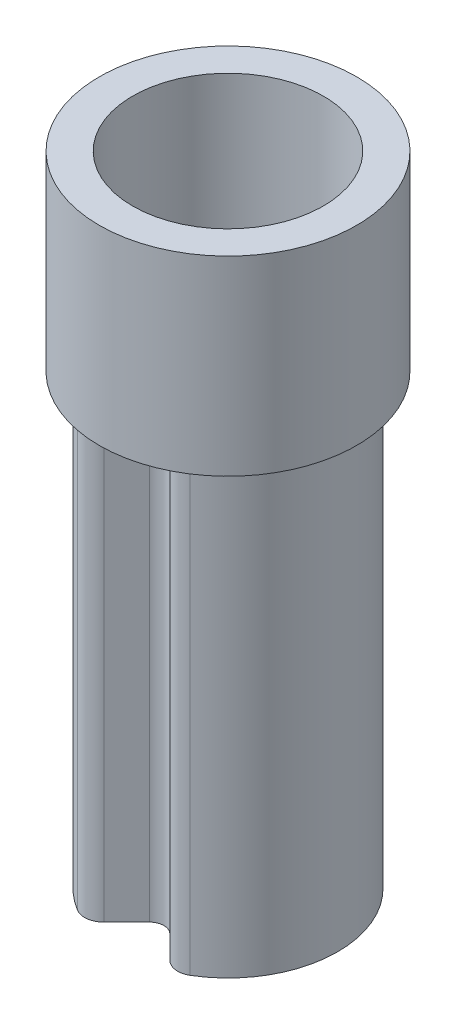
ISO-10303-21;
HEADER;
FILE_DESCRIPTION(('STEP AP214'),'2;1');
FILE_NAME('part.step','',(''),(''),'','','');
FILE_SCHEMA(('AUTOMOTIVE_DESIGN { 1 0 10303 214 1 1 1 1 }'));
ENDSEC;
DATA;
#1=APPLICATION_CONTEXT('core data for automotive mechanical design processes');
#2=APPLICATION_PROTOCOL_DEFINITION('international standard','automotive_design',2000,#1);
#3=PRODUCT_CONTEXT('',#1,'mechanical');
#4=PRODUCT('Part','Part','',(#3));
#5=PRODUCT_RELATED_PRODUCT_CATEGORY('part','',(#4));
#6=PRODUCT_DEFINITION_FORMATION('','',#4);
#7=PRODUCT_DEFINITION_CONTEXT('part definition',#1,'design');
#8=PRODUCT_DEFINITION('design','',#6,#7);
#9=PRODUCT_DEFINITION_SHAPE('','',#8);
#10=(LENGTH_UNIT() NAMED_UNIT(*) SI_UNIT(.MILLI.,.METRE.));
#11=(NAMED_UNIT(*) PLANE_ANGLE_UNIT() SI_UNIT($,.RADIAN.));
#12=(NAMED_UNIT(*) SI_UNIT($,.STERADIAN.) SOLID_ANGLE_UNIT());
#13=UNCERTAINTY_MEASURE_WITH_UNIT(LENGTH_MEASURE(1.E-05),#10,'distance_accuracy_value','');
#14=(GEOMETRIC_REPRESENTATION_CONTEXT(3) GLOBAL_UNCERTAINTY_ASSIGNED_CONTEXT((#13)) GLOBAL_UNIT_ASSIGNED_CONTEXT((#10,
#11,#12)) REPRESENTATION_CONTEXT('',''));
#15=CARTESIAN_POINT('',(0.,0.,0.));
#16=DIRECTION('',(0.,0.,1.));
#17=DIRECTION('',(1.,0.,0.));
#18=AXIS2_PLACEMENT_3D('',#15,#16,#17);
#19=CARTESIAN_POINT('',(0.,4.7,0.822132034355964));
#20=DIRECTION('',(0.,1.,0.));
#21=DIRECTION('',(0.,0.,1.));
#22=AXIS2_PLACEMENT_3D('',#19,#20,#21);
#23=PLANE('',#22);
#24=DIRECTION('',(0.707106781186548,0.,0.707106781186548));
#25=VECTOR('',#24,1.);
#26=CARTESIAN_POINT('',(0.106066017177983,4.7,0.716066017177983));
#27=LINE('',#26,#25);
#28=CARTESIAN_POINT('',(0.106066017177983,4.7,0.716066017177983));
#29=VERTEX_POINT('',#28);
#30=CARTESIAN_POINT('',(0.332945922473057,4.7,0.942945922473057));
#31=VERTEX_POINT('',#30);
#32=EDGE_CURVE('E154',#29,#31,#27,.T.);
#33=ORIENTED_EDGE('',*,*,#32,.T.);
#34=CARTESIAN_POINT('',(0.,4.7,0.));
#35=DIRECTION('',(0.,1.,0.));
#36=DIRECTION('',(0.,0.,1.));
#37=AXIS2_PLACEMENT_3D('',#34,#35,#36);
#38=CIRCLE('',#37,1.);
#39=CARTESIAN_POINT('',(0.513633561053512,4.7,0.858009653185492));
#40=VERTEX_POINT('',#39);
#41=EDGE_CURVE('E137',#31,#40,#38,.T.);
#42=ORIENTED_EDGE('',*,*,#41,.T.);
#43=CARTESIAN_POINT('',(0.487951883000836,4.7,0.815109170526217));
#44=DIRECTION('',(0.,1.,0.));
#45=DIRECTION('',(0.,0.,1.));
#46=AXIS2_PLACEMENT_3D('',#43,#44,#45);
#47=CIRCLE('',#46,0.05);
#48=CARTESIAN_POINT('',(0.452596543941509,4.7,0.850464509585545));
#49=VERTEX_POINT('',#48);
#50=EDGE_CURVE('E194',#40,#49,#47,.F.);
#51=ORIENTED_EDGE('',*,*,#50,.T.);
#52=DIRECTION('',(0.707106781186548,0.,0.707106781186547));
#53=VECTOR('',#52,1.);
#54=CARTESIAN_POINT('',(0.212132034355966,4.7,0.610000000000001));
#55=LINE('',#54,#53);
#56=CARTESIAN_POINT('',(0.212132034355966,4.7,0.610000000000002));
#57=VERTEX_POINT('',#56);
#58=EDGE_CURVE('E227',#57,#49,#55,.T.);
#59=ORIENTED_EDGE('',*,*,#58,.F.);
#60=CARTESIAN_POINT('',(0.,4.7,0.822132034355964));
#61=DIRECTION('',(0.,-1.,0.));
#62=DIRECTION('',(0.,0.,1.));
#63=AXIS2_PLACEMENT_3D('',#60,#61,#62);
#64=CIRCLE('',#63,0.3);
#65=CARTESIAN_POINT('',(-0.212132034355965,4.7,0.610000000000001));
#66=VERTEX_POINT('',#65);
#67=EDGE_CURVE('E223',#66,#57,#64,.T.);
#68=ORIENTED_EDGE('',*,*,#67,.F.);
#69=DIRECTION('',(0.707106781186547,0.,-0.707106781186548));
#70=VECTOR('',#69,1.);
#71=CARTESIAN_POINT('',(-0.479612456619358,4.7,0.877480422263394));
#72=LINE('',#71,#70);
#73=CARTESIAN_POINT('',(-0.452596543941509,4.7,0.850464509585545));
#74=VERTEX_POINT('',#73);
#75=EDGE_CURVE('E221',#74,#66,#72,.T.);
#76=ORIENTED_EDGE('',*,*,#75,.F.);
#77=CARTESIAN_POINT('',(-0.487951883000836,4.7,0.815109170526218));
#78=DIRECTION('',(0.,1.,0.));
#79=DIRECTION('',(0.,0.,1.));
#80=AXIS2_PLACEMENT_3D('',#77,#78,#79);
#81=CIRCLE('',#80,0.05);
#82=CARTESIAN_POINT('',(-0.513633561053512,4.7,0.858009653185492));
#83=VERTEX_POINT('',#82);
#84=EDGE_CURVE('E197',#74,#83,#81,.F.);
#85=ORIENTED_EDGE('',*,*,#84,.T.);
#86=CARTESIAN_POINT('',(-0.332945922473057,4.7,0.942945922473057));
#87=VERTEX_POINT('',#86);
#88=EDGE_CURVE('E12',#83,#87,#38,.T.);
#89=ORIENTED_EDGE('',*,*,#88,.T.);
#90=DIRECTION('',(0.707106781186547,0.,-0.707106781186548));
#91=VECTOR('',#90,1.);
#92=CARTESIAN_POINT('',(-0.448807004477936,4.7,1.05880700447794));
#93=LINE('',#92,#91);
#94=CARTESIAN_POINT('',(-0.106066017177983,4.7,0.716066017177983));
#95=VERTEX_POINT('',#94);
#96=EDGE_CURVE('E164',#87,#95,#93,.T.);
#97=ORIENTED_EDGE('',*,*,#96,.T.);
#98=CARTESIAN_POINT('',(0.,4.7,0.822132034355964));
#99=DIRECTION('',(0.,-1.,0.));
#100=DIRECTION('',(0.,0.,1.));
#101=AXIS2_PLACEMENT_3D('',#98,#99,#100);
#102=CIRCLE('',#101,0.15);
#103=EDGE_CURVE('E159',#95,#29,#102,.T.);
#104=ORIENTED_EDGE('',*,*,#103,.T.);
#105=EDGE_LOOP('',(#33,#42,#51,#59,#68,#76,#85,#89,#97,#104));
#106=FACE_BOUND('',#105,.T.);
#107=ADVANCED_FACE('F36',(#106),#23,.T.);
#108=CARTESIAN_POINT('',(0.,0.,0.822132034355964));
#109=DIRECTION('',(0.,1.,0.));
#110=DIRECTION('',(0.,0.,1.));
#111=AXIS2_PLACEMENT_3D('',#108,#109,#110);
#112=PLANE('',#111);
#113=CARTESIAN_POINT('',(0.,0.,0.));
#114=DIRECTION('',(0.,1.,0.));
#115=DIRECTION('',(0.,0.,1.));
#116=AXIS2_PLACEMENT_3D('',#113,#114,#115);
#117=CIRCLE('',#116,1.15);
#118=CARTESIAN_POINT('',(0.590678595211539,0.,0.986711101163316));
#119=VERTEX_POINT('',#118);
#120=CARTESIAN_POINT('',(-0.590678595211538,0.,0.986711101163316));
#121=VERTEX_POINT('',#120);
#122=EDGE_CURVE('E177',#119,#121,#117,.T.);
#123=ORIENTED_EDGE('',*,*,#122,.F.);
#124=CARTESIAN_POINT('',(0.487951883000836,0.,0.815109170526217));
#125=DIRECTION('',(0.,1.,0.));
#126=DIRECTION('',(0.,0.,1.));
#127=AXIS2_PLACEMENT_3D('',#124,#125,#126);
#128=CIRCLE('',#127,0.2);
#129=CARTESIAN_POINT('',(0.346530526763527,0.,0.956530526763527));
#130=VERTEX_POINT('',#129);
#131=EDGE_CURVE('E61',#119,#130,#128,.F.);
#132=ORIENTED_EDGE('',*,*,#131,.T.);
#133=DIRECTION('',(0.707106781186548,0.,0.707106781186548));
#134=VECTOR('',#133,1.);
#135=CARTESIAN_POINT('',(0.106066017177983,0.,0.716066017177983));
#136=LINE('',#135,#134);
#137=CARTESIAN_POINT('',(0.106066017177983,0.,0.716066017177983));
#138=VERTEX_POINT('',#137);
#139=EDGE_CURVE('E174',#138,#130,#136,.T.);
#140=ORIENTED_EDGE('',*,*,#139,.F.);
#141=CARTESIAN_POINT('',(0.,0.,0.822132034355964));
#142=DIRECTION('',(0.,-1.,0.));
#143=DIRECTION('',(0.,0.,1.));
#144=AXIS2_PLACEMENT_3D('',#141,#142,#143);
#145=CIRCLE('',#144,0.15);
#146=CARTESIAN_POINT('',(-0.106066017177983,0.,0.716066017177983));
#147=VERTEX_POINT('',#146);
#148=EDGE_CURVE('E171',#147,#138,#145,.T.);
#149=ORIENTED_EDGE('',*,*,#148,.F.);
#150=DIRECTION('',(0.707106781186547,0.,-0.707106781186548));
#151=VECTOR('',#150,1.);
#152=CARTESIAN_POINT('',(-0.448807004477936,0.,1.05880700447794));
#153=LINE('',#152,#151);
#154=CARTESIAN_POINT('',(-0.346530526763527,0.,0.956530526763527));
#155=VERTEX_POINT('',#154);
#156=EDGE_CURVE('E180',#155,#147,#153,.T.);
#157=ORIENTED_EDGE('',*,*,#156,.F.);
#158=CARTESIAN_POINT('',(-0.487951883000836,0.,0.815109170526217));
#159=DIRECTION('',(0.,1.,0.));
#160=DIRECTION('',(0.,0.,1.));
#161=AXIS2_PLACEMENT_3D('',#158,#159,#160);
#162=CIRCLE('',#161,0.2);
#163=EDGE_CURVE('E204',#155,#121,#162,.F.);
#164=ORIENTED_EDGE('',*,*,#163,.T.);
#165=EDGE_LOOP('',(#123,#132,#140,#149,#157,#164));
#166=FACE_BOUND('',#165,.T.);
#167=DIRECTION('',(0.707106781186548,0.,0.707106781186547));
#168=VECTOR('',#167,1.);
#169=CARTESIAN_POINT('',(0.212132034355966,0.,0.610000000000001));
#170=LINE('',#169,#168);
#171=CARTESIAN_POINT('',(0.212132034355966,0.,0.610000000000002));
#172=VERTEX_POINT('',#171);
#173=CARTESIAN_POINT('',(0.452596543941509,0.,0.850464509585545));
#174=VERTEX_POINT('',#173);
#175=EDGE_CURVE('E224',#172,#174,#170,.T.);
#176=ORIENTED_EDGE('',*,*,#175,.T.);
#177=CARTESIAN_POINT('',(0.487951883000836,0.,0.815109170526217));
#178=DIRECTION('',(0.,1.,0.));
#179=DIRECTION('',(0.,0.,1.));
#180=AXIS2_PLACEMENT_3D('',#177,#178,#179);
#181=CIRCLE('',#180,0.05);
#182=CARTESIAN_POINT('',(0.513633561053512,0.,0.858009653185492));
#183=VERTEX_POINT('',#182);
#184=EDGE_CURVE('E192',#174,#183,#181,.T.);
#185=ORIENTED_EDGE('',*,*,#184,.T.);
#186=CARTESIAN_POINT('',(0.,0.,0.));
#187=DIRECTION('',(0.,1.,0.));
#188=DIRECTION('',(0.,0.,1.));
#189=AXIS2_PLACEMENT_3D('',#186,#187,#188);
#190=CIRCLE('',#189,1.);
#191=CARTESIAN_POINT('',(-0.513633561053512,0.,0.858009653185492));
#192=VERTEX_POINT('',#191);
#193=EDGE_CURVE('E231',#183,#192,#190,.T.);
#194=ORIENTED_EDGE('',*,*,#193,.T.);
#195=CARTESIAN_POINT('',(-0.487951883000836,0.,0.815109170526218));
#196=DIRECTION('',(0.,1.,0.));
#197=DIRECTION('',(0.,0.,1.));
#198=AXIS2_PLACEMENT_3D('',#195,#196,#197);
#199=CIRCLE('',#198,0.05);
#200=CARTESIAN_POINT('',(-0.452596543941509,0.,0.850464509585545));
#201=VERTEX_POINT('',#200);
#202=EDGE_CURVE('E195',#192,#201,#199,.T.);
#203=ORIENTED_EDGE('',*,*,#202,.T.);
#204=DIRECTION('',(0.707106781186547,0.,-0.707106781186548));
#205=VECTOR('',#204,1.);
#206=CARTESIAN_POINT('',(-0.479612456619358,0.,0.877480422263394));
#207=LINE('',#206,#205);
#208=CARTESIAN_POINT('',(-0.212132034355965,0.,0.610000000000001));
#209=VERTEX_POINT('',#208);
#210=EDGE_CURVE('E234',#201,#209,#207,.T.);
#211=ORIENTED_EDGE('',*,*,#210,.T.);
#212=CARTESIAN_POINT('',(0.,0.,0.822132034355964));
#213=DIRECTION('',(0.,-1.,0.));
#214=DIRECTION('',(0.,0.,1.));
#215=AXIS2_PLACEMENT_3D('',#212,#213,#214);
#216=CIRCLE('',#215,0.3);
#217=EDGE_CURVE('E237',#209,#172,#216,.T.);
#218=ORIENTED_EDGE('',*,*,#217,.T.);
#219=EDGE_LOOP('',(#176,#185,#194,#203,#211,#218));
#220=FACE_BOUND('',#219,.T.);
#221=ADVANCED_FACE('F255',(#166,#220),#112,.F.);
#222=CARTESIAN_POINT('',(0.,4.7,0.822132034355964));
#223=DIRECTION('',(0.,-1.,0.));
#224=DIRECTION('',(0.,0.,-1.));
#225=AXIS2_PLACEMENT_3D('',#222,#223,#224);
#226=CYLINDRICAL_SURFACE('',#225,0.15);
#227=ORIENTED_EDGE('',*,*,#148,.T.);
#228=DIRECTION('',(0.,-1.,0.));
#229=VECTOR('',#228,1.);
#230=CARTESIAN_POINT('',(0.106066017177983,4.7,0.716066017177983));
#231=LINE('',#230,#229);
#232=EDGE_CURVE('E184',#29,#138,#231,.T.);
#233=ORIENTED_EDGE('',*,*,#232,.F.);
#234=ORIENTED_EDGE('',*,*,#103,.F.);
#235=DIRECTION('',(0.,-1.,0.));
#236=VECTOR('',#235,1.);
#237=CARTESIAN_POINT('',(-0.106066017177983,4.7,0.716066017177983));
#238=LINE('',#237,#236);
#239=EDGE_CURVE('E170',#95,#147,#238,.T.);
#240=ORIENTED_EDGE('',*,*,#239,.T.);
#241=EDGE_LOOP('',(#227,#233,#234,#240));
#242=FACE_BOUND('',#241,.T.);
#243=ADVANCED_FACE('F291',(#242),#226,.F.);
#244=CARTESIAN_POINT('',(0.106066017177983,4.7,0.716066017177983));
#245=DIRECTION('',(0.707106781186548,0.,-0.707106781186547));
#246=DIRECTION('',(-0.707106781186547,0.,-0.707106781186548));
#247=AXIS2_PLACEMENT_3D('',#244,#245,#246);
#248=PLANE('',#247);
#249=ORIENTED_EDGE('',*,*,#139,.T.);
#250=DIRECTION('',(0.,-1.,0.));
#251=VECTOR('',#250,1.);
#252=CARTESIAN_POINT('',(0.346530526763527,4.7,0.956530526763527));
#253=LINE('',#252,#251);
#254=CARTESIAN_POINT('',(0.346530526763527,4.7,0.956530526763527));
#255=VERTEX_POINT('',#254);
#256=EDGE_CURVE('E157',#130,#255,#253,.F.);
#257=ORIENTED_EDGE('',*,*,#256,.T.);
#258=EDGE_CURVE('E133',#31,#255,#27,.T.);
#259=ORIENTED_EDGE('',*,*,#258,.F.);
#260=ORIENTED_EDGE('',*,*,#32,.F.);
#261=ORIENTED_EDGE('',*,*,#232,.T.);
#262=EDGE_LOOP('',(#249,#257,#259,#260,#261));
#263=FACE_BOUND('',#262,.T.);
#264=ADVANCED_FACE('F152',(#263),#248,.F.);
#265=CARTESIAN_POINT('',(0.,4.7,0.));
#266=DIRECTION('',(0.,-1.,0.));
#267=DIRECTION('',(0.,0.,-1.));
#268=AXIS2_PLACEMENT_3D('',#265,#266,#267);
#269=CYLINDRICAL_SURFACE('',#268,1.15);
#270=CARTESIAN_POINT('',(0.,4.7,0.));
#271=DIRECTION('',(0.,1.,0.));
#272=DIRECTION('',(0.,0.,1.));
#273=AXIS2_PLACEMENT_3D('',#270,#271,#272);
#274=CIRCLE('',#273,1.15);
#275=CARTESIAN_POINT('',(0.590678595211539,4.7,0.986711101163316));
#276=VERTEX_POINT('',#275);
#277=CARTESIAN_POINT('',(-0.590678595211538,4.7,0.986711101163316));
#278=VERTEX_POINT('',#277);
#279=EDGE_CURVE('E163',#276,#278,#274,.T.);
#280=ORIENTED_EDGE('',*,*,#279,.F.);
#281=DIRECTION('',(0.,-1.,0.));
#282=VECTOR('',#281,1.);
#283=CARTESIAN_POINT('',(0.590678595211539,4.7,0.986711101163316));
#284=LINE('',#283,#282);
#285=EDGE_CURVE('E201',#276,#119,#284,.T.);
#286=ORIENTED_EDGE('',*,*,#285,.T.);
#287=ORIENTED_EDGE('',*,*,#122,.T.);
#288=DIRECTION('',(0.,-1.,0.));
#289=VECTOR('',#288,1.);
#290=CARTESIAN_POINT('',(-0.590678595211539,4.7,0.986711101163316));
#291=LINE('',#290,#289);
#292=EDGE_CURVE('E198',#121,#278,#291,.F.);
#293=ORIENTED_EDGE('',*,*,#292,.T.);
#294=EDGE_LOOP('',(#280,#286,#287,#293));
#295=FACE_BOUND('',#294,.T.);
#296=ADVANCED_FACE('F299',(#295),#269,.T.);
#297=CARTESIAN_POINT('',(-0.448807004477936,4.7,1.05880700447794));
#298=DIRECTION('',(-0.707106781186548,0.,-0.707106781186547));
#299=DIRECTION('',(-0.707106781186547,0.,0.707106781186548));
#300=AXIS2_PLACEMENT_3D('',#297,#298,#299);
#301=PLANE('',#300);
#302=CARTESIAN_POINT('',(-0.346530526763527,4.7,0.956530526763527));
#303=VERTEX_POINT('',#302);
#304=EDGE_CURVE('E136',#303,#87,#93,.T.);
#305=ORIENTED_EDGE('',*,*,#304,.F.);
#306=DIRECTION('',(0.,-1.,0.));
#307=VECTOR('',#306,1.);
#308=CARTESIAN_POINT('',(-0.346530526763527,4.7,0.956530526763527));
#309=LINE('',#308,#307);
#310=EDGE_CURVE('E45',#303,#155,#309,.T.);
#311=ORIENTED_EDGE('',*,*,#310,.T.);
#312=ORIENTED_EDGE('',*,*,#156,.T.);
#313=ORIENTED_EDGE('',*,*,#239,.F.);
#314=ORIENTED_EDGE('',*,*,#96,.F.);
#315=EDGE_LOOP('',(#305,#311,#312,#313,#314));
#316=FACE_BOUND('',#315,.T.);
#317=ADVANCED_FACE('F296',(#316),#301,.F.);
#318=CARTESIAN_POINT('',(0.,4.7,0.));
#319=DIRECTION('',(0.,-1.,0.));
#320=DIRECTION('',(0.,0.,-1.));
#321=AXIS2_PLACEMENT_3D('',#318,#319,#320);
#322=CYLINDRICAL_SURFACE('',#321,1.);
#323=ORIENTED_EDGE('',*,*,#193,.F.);
#324=DIRECTION('',(0.,-1.,0.));
#325=VECTOR('',#324,1.);
#326=CARTESIAN_POINT('',(0.513633561053512,4.7,0.858009653185492));
#327=LINE('',#326,#325);
#328=EDGE_CURVE('E145',#183,#40,#327,.F.);
#329=ORIENTED_EDGE('',*,*,#328,.T.);
#330=ORIENTED_EDGE('',*,*,#41,.F.);
#331=EDGE_CURVE('E53',#87,#31,#38,.T.);
#332=ORIENTED_EDGE('',*,*,#331,.F.);
#333=ORIENTED_EDGE('',*,*,#88,.F.);
#334=DIRECTION('',(0.,-1.,0.));
#335=VECTOR('',#334,1.);
#336=CARTESIAN_POINT('',(-0.513633561053512,4.7,0.858009653185492));
#337=LINE('',#336,#335);
#338=EDGE_CURVE('E189',#83,#192,#337,.T.);
#339=ORIENTED_EDGE('',*,*,#338,.T.);
#340=EDGE_LOOP('',(#323,#329,#330,#332,#333,#339));
#341=FACE_BOUND('',#340,.T.);
#342=CARTESIAN_POINT('',(0.,6.7,0.));
#343=DIRECTION('',(0.,1.,0.));
#344=DIRECTION('',(0.,0.,1.));
#345=AXIS2_PLACEMENT_3D('',#342,#343,#344);
#346=CIRCLE('',#345,1.);
#347=CARTESIAN_POINT('',(0.,6.7,1.));
#348=VERTEX_POINT('',#347);
#349=EDGE_CURVE('E138',#348,#348,#346,.T.);
#350=ORIENTED_EDGE('',*,*,#349,.T.);
#351=EDGE_LOOP('',(#350));
#352=FACE_BOUND('',#351,.T.);
#353=ADVANCED_FACE('F142',(#341,#352),#322,.F.);
#354=CARTESIAN_POINT('',(-0.479612456619358,4.7,0.877480422263394));
#355=DIRECTION('',(-0.707106781186548,0.,-0.707106781186547));
#356=DIRECTION('',(-0.707106781186547,0.,0.707106781186548));
#357=AXIS2_PLACEMENT_3D('',#354,#355,#356);
#358=PLANE('',#357);
#359=ORIENTED_EDGE('',*,*,#210,.F.);
#360=DIRECTION('',(0.,1.,0.));
#361=VECTOR('',#360,1.);
#362=CARTESIAN_POINT('',(-0.452596543941509,4.7,0.850464509585545));
#363=LINE('',#362,#361);
#364=EDGE_CURVE('E190',#201,#74,#363,.T.);
#365=ORIENTED_EDGE('',*,*,#364,.T.);
#366=ORIENTED_EDGE('',*,*,#75,.T.);
#367=DIRECTION('',(0.,-1.,0.));
#368=VECTOR('',#367,1.);
#369=CARTESIAN_POINT('',(-0.212132034355965,4.7,0.610000000000001));
#370=LINE('',#369,#368);
#371=EDGE_CURVE('E175',#66,#209,#370,.T.);
#372=ORIENTED_EDGE('',*,*,#371,.T.);
#373=EDGE_LOOP('',(#359,#365,#366,#372));
#374=FACE_BOUND('',#373,.T.);
#375=ADVANCED_FACE('F247',(#374),#358,.T.);
#376=CARTESIAN_POINT('',(0.,4.7,0.822132034355964));
#377=DIRECTION('',(0.,-1.,0.));
#378=DIRECTION('',(0.,0.,-1.));
#379=AXIS2_PLACEMENT_3D('',#376,#377,#378);
#380=CYLINDRICAL_SURFACE('',#379,0.3);
#381=ORIENTED_EDGE('',*,*,#217,.F.);
#382=ORIENTED_EDGE('',*,*,#371,.F.);
#383=ORIENTED_EDGE('',*,*,#67,.T.);
#384=DIRECTION('',(0.,-1.,0.));
#385=VECTOR('',#384,1.);
#386=CARTESIAN_POINT('',(0.212132034355966,4.7,0.610000000000002));
#387=LINE('',#386,#385);
#388=EDGE_CURVE('E230',#57,#172,#387,.T.);
#389=ORIENTED_EDGE('',*,*,#388,.T.);
#390=EDGE_LOOP('',(#381,#382,#383,#389));
#391=FACE_BOUND('',#390,.T.);
#392=ADVANCED_FACE('F252',(#391),#380,.T.);
#393=CARTESIAN_POINT('',(0.212132034355966,4.7,0.610000000000001));
#394=DIRECTION('',(0.707106781186547,0.,-0.707106781186548));
#395=DIRECTION('',(-0.707106781186548,0.,-0.707106781186547));
#396=AXIS2_PLACEMENT_3D('',#393,#394,#395);
#397=PLANE('',#396);
#398=ORIENTED_EDGE('',*,*,#58,.T.);
#399=DIRECTION('',(0.,1.,0.));
#400=VECTOR('',#399,1.);
#401=CARTESIAN_POINT('',(0.452596543941509,0.,0.850464509585545));
#402=LINE('',#401,#400);
#403=EDGE_CURVE('E186',#49,#174,#402,.F.);
#404=ORIENTED_EDGE('',*,*,#403,.T.);
#405=ORIENTED_EDGE('',*,*,#175,.F.);
#406=ORIENTED_EDGE('',*,*,#388,.F.);
#407=EDGE_LOOP('',(#398,#404,#405,#406));
#408=FACE_BOUND('',#407,.T.);
#409=ADVANCED_FACE('F274',(#408),#397,.T.);
#410=CARTESIAN_POINT('',(0.487951883000836,4.7,0.815109170526217));
#411=DIRECTION('',(0.,-1.,0.));
#412=DIRECTION('',(0.,0.,-1.));
#413=AXIS2_PLACEMENT_3D('',#410,#411,#412);
#414=CYLINDRICAL_SURFACE('',#413,0.05);
#415=ORIENTED_EDGE('',*,*,#50,.F.);
#416=ORIENTED_EDGE('',*,*,#328,.F.);
#417=ORIENTED_EDGE('',*,*,#184,.F.);
#418=ORIENTED_EDGE('',*,*,#403,.F.);
#419=EDGE_LOOP('',(#415,#416,#417,#418));
#420=FACE_BOUND('',#419,.T.);
#421=ADVANCED_FACE('F275',(#420),#414,.F.);
#422=CARTESIAN_POINT('',(-0.487951883000836,4.7,0.815109170526218));
#423=DIRECTION('',(0.,-1.,0.));
#424=DIRECTION('',(0.,0.,-1.));
#425=AXIS2_PLACEMENT_3D('',#422,#423,#424);
#426=CYLINDRICAL_SURFACE('',#425,0.05);
#427=ORIENTED_EDGE('',*,*,#84,.F.);
#428=ORIENTED_EDGE('',*,*,#364,.F.);
#429=ORIENTED_EDGE('',*,*,#202,.F.);
#430=ORIENTED_EDGE('',*,*,#338,.F.);
#431=EDGE_LOOP('',(#427,#428,#429,#430));
#432=FACE_BOUND('',#431,.T.);
#433=ADVANCED_FACE('F260',(#432),#426,.F.);
#434=CARTESIAN_POINT('',(0.487951883000836,4.7,0.815109170526217));
#435=DIRECTION('',(0.,-1.,0.));
#436=DIRECTION('',(0.,0.,-1.));
#437=AXIS2_PLACEMENT_3D('',#434,#435,#436);
#438=CYLINDRICAL_SURFACE('',#437,0.2);
#439=CARTESIAN_POINT('',(0.487951883000836,4.7,0.815109170526217));
#440=DIRECTION('',(0.,1.,0.));
#441=DIRECTION('',(0.,0.,1.));
#442=AXIS2_PLACEMENT_3D('',#439,#440,#441);
#443=CIRCLE('',#442,0.2);
#444=EDGE_CURVE('E210',#255,#276,#443,.T.);
#445=ORIENTED_EDGE('',*,*,#444,.F.);
#446=ORIENTED_EDGE('',*,*,#256,.F.);
#447=ORIENTED_EDGE('',*,*,#131,.F.);
#448=ORIENTED_EDGE('',*,*,#285,.F.);
#449=EDGE_LOOP('',(#445,#446,#447,#448));
#450=FACE_BOUND('',#449,.T.);
#451=ADVANCED_FACE('F282',(#450),#438,.T.);
#452=CARTESIAN_POINT('',(-0.487951883000836,4.7,0.815109170526217));
#453=DIRECTION('',(0.,-1.,0.));
#454=DIRECTION('',(0.,0.,-1.));
#455=AXIS2_PLACEMENT_3D('',#452,#453,#454);
#456=CYLINDRICAL_SURFACE('',#455,0.2);
#457=CARTESIAN_POINT('',(-0.487951883000836,4.7,0.815109170526217));
#458=DIRECTION('',(0.,1.,0.));
#459=DIRECTION('',(0.,0.,1.));
#460=AXIS2_PLACEMENT_3D('',#457,#458,#459);
#461=CIRCLE('',#460,0.2);
#462=EDGE_CURVE('E208',#278,#303,#461,.T.);
#463=ORIENTED_EDGE('',*,*,#462,.F.);
#464=ORIENTED_EDGE('',*,*,#292,.F.);
#465=ORIENTED_EDGE('',*,*,#163,.F.);
#466=ORIENTED_EDGE('',*,*,#310,.F.);
#467=EDGE_LOOP('',(#463,#464,#465,#466));
#468=FACE_BOUND('',#467,.T.);
#469=ADVANCED_FACE('F38',(#468),#456,.T.);
#470=CARTESIAN_POINT('',(0.,4.7,0.));
#471=DIRECTION('',(0.,1.,0.));
#472=DIRECTION('',(0.,0.,1.));
#473=AXIS2_PLACEMENT_3D('',#470,#471,#472);
#474=PLANE('',#473);
#475=CARTESIAN_POINT('',(0.,4.7,0.));
#476=DIRECTION('',(0.,1.,0.));
#477=DIRECTION('',(0.,0.,1.));
#478=AXIS2_PLACEMENT_3D('',#475,#476,#477);
#479=CIRCLE('',#478,1.35);
#480=CARTESIAN_POINT('',(0.,4.7,1.35));
#481=VERTEX_POINT('',#480);
#482=EDGE_CURVE('E149',#481,#481,#479,.T.);
#483=ORIENTED_EDGE('',*,*,#482,.F.);
#484=EDGE_LOOP('',(#483));
#485=FACE_BOUND('',#484,.T.);
#486=ORIENTED_EDGE('',*,*,#331,.T.);
#487=ORIENTED_EDGE('',*,*,#258,.T.);
#488=ORIENTED_EDGE('',*,*,#444,.T.);
#489=ORIENTED_EDGE('',*,*,#279,.T.);
#490=ORIENTED_EDGE('',*,*,#462,.T.);
#491=ORIENTED_EDGE('',*,*,#304,.T.);
#492=EDGE_LOOP('',(#486,#487,#488,#489,#490,#491));
#493=FACE_BOUND('',#492,.T.);
#494=ADVANCED_FACE('F131',(#485,#493),#474,.F.);
#495=CARTESIAN_POINT('',(0.,17.2183766184074,0.));
#496=DIRECTION('',(0.,-1.,0.));
#497=DIRECTION('',(0.,0.,-1.));
#498=AXIS2_PLACEMENT_3D('',#495,#496,#497);
#499=CYLINDRICAL_SURFACE('',#498,1.35);
#500=ORIENTED_EDGE('',*,*,#482,.T.);
#501=EDGE_LOOP('',(#500));
#502=FACE_BOUND('',#501,.T.);
#503=CARTESIAN_POINT('',(0.,6.7,0.));
#504=DIRECTION('',(0.,1.,0.));
#505=DIRECTION('',(0.,0.,1.));
#506=AXIS2_PLACEMENT_3D('',#503,#504,#505);
#507=CIRCLE('',#506,1.35);
#508=CARTESIAN_POINT('',(0.,6.7,1.35));
#509=VERTEX_POINT('',#508);
#510=EDGE_CURVE('E235',#509,#509,#507,.T.);
#511=ORIENTED_EDGE('',*,*,#510,.F.);
#512=EDGE_LOOP('',(#511));
#513=FACE_BOUND('',#512,.T.);
#514=ADVANCED_FACE('F325',(#502,#513),#499,.T.);
#515=CARTESIAN_POINT('',(0.,6.7,0.822132034355964));
#516=DIRECTION('',(0.,1.,0.));
#517=DIRECTION('',(0.,0.,1.));
#518=AXIS2_PLACEMENT_3D('',#515,#516,#517);
#519=PLANE('',#518);
#520=ORIENTED_EDGE('',*,*,#349,.F.);
#521=EDGE_LOOP('',(#520));
#522=FACE_BOUND('',#521,.T.);
#523=ORIENTED_EDGE('',*,*,#510,.T.);
#524=EDGE_LOOP('',(#523));
#525=FACE_BOUND('',#524,.T.);
#526=ADVANCED_FACE('F407',(#522,#525),#519,.T.);
#527=CLOSED_SHELL('',(#107,#221,#243,#264,#296,#317,#353,#375,#392,#409,#421,#433,#451,#469,
#494,#514,#526));
#528=MANIFOLD_SOLID_BREP('B2',#527);
#529=ADVANCED_BREP_SHAPE_REPRESENTATION('',(#18,#528),#14);
#530=SHAPE_DEFINITION_REPRESENTATION(#9,#529);
ENDSEC;
END-ISO-10303-21;
